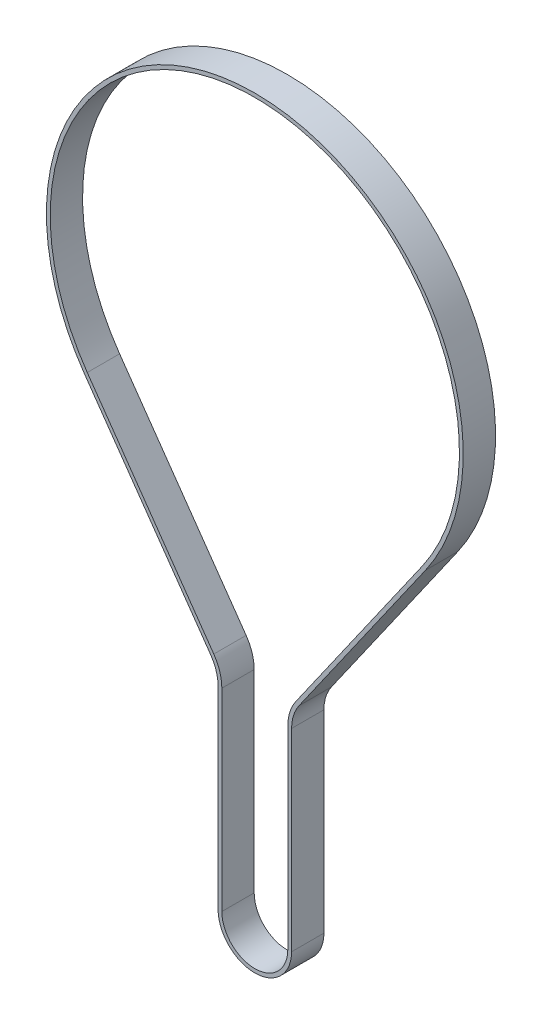
ISO-10303-21;
HEADER;
FILE_DESCRIPTION(('STEP AP214'),'2;1');
FILE_NAME('part.step','',(''),(''),'','','');
FILE_SCHEMA(('AUTOMOTIVE_DESIGN { 1 0 10303 214 1 1 1 1 }'));
ENDSEC;
DATA;
#1=APPLICATION_CONTEXT('core data for automotive mechanical design processes');
#2=APPLICATION_PROTOCOL_DEFINITION('international standard','automotive_design',2000,#1);
#3=PRODUCT_CONTEXT('',#1,'mechanical');
#4=PRODUCT('Part','Part','',(#3));
#5=PRODUCT_RELATED_PRODUCT_CATEGORY('part','',(#4));
#6=PRODUCT_DEFINITION_FORMATION('','',#4);
#7=PRODUCT_DEFINITION_CONTEXT('part definition',#1,'design');
#8=PRODUCT_DEFINITION('design','',#6,#7);
#9=PRODUCT_DEFINITION_SHAPE('','',#8);
#10=(LENGTH_UNIT() NAMED_UNIT(*) SI_UNIT(.MILLI.,.METRE.));
#11=(NAMED_UNIT(*) PLANE_ANGLE_UNIT() SI_UNIT($,.RADIAN.));
#12=(NAMED_UNIT(*) SI_UNIT($,.STERADIAN.) SOLID_ANGLE_UNIT());
#13=UNCERTAINTY_MEASURE_WITH_UNIT(LENGTH_MEASURE(1.E-05),#10,'distance_accuracy_value','');
#14=(GEOMETRIC_REPRESENTATION_CONTEXT(3) GLOBAL_UNCERTAINTY_ASSIGNED_CONTEXT((#13)) GLOBAL_UNIT_ASSIGNED_CONTEXT((#10,
#11,#12)) REPRESENTATION_CONTEXT('',''));
#15=CARTESIAN_POINT('',(0.,0.,0.));
#16=DIRECTION('',(0.,0.,1.));
#17=DIRECTION('',(1.,0.,0.));
#18=AXIS2_PLACEMENT_3D('',#15,#16,#17);
#19=CARTESIAN_POINT('',(-14.3662,35.8706999567669,6.));
#20=DIRECTION('',(0.,0.,1.));
#21=DIRECTION('',(1.,0.,0.));
#22=AXIS2_PLACEMENT_3D('',#19,#20,#21);
#23=PLANE('',#22);
#24=CARTESIAN_POINT('',(-14.3662,35.8706999567669,6.));
#25=DIRECTION('',(0.,0.,-1.));
#26=DIRECTION('',(1.,0.,0.));
#27=AXIS2_PLACEMENT_3D('',#24,#25,#26);
#28=CIRCLE('',#27,7.55);
#29=CARTESIAN_POINT('',(-8.18313892876234,40.20339609074,6.));
#30=VERTEX_POINT('',#29);
#31=CARTESIAN_POINT('',(-6.8162,35.8706999567669,6.));
#32=VERTEX_POINT('',#31);
#33=EDGE_CURVE('E211',#30,#32,#28,.T.);
#34=ORIENTED_EDGE('',*,*,#33,.T.);
#35=DIRECTION('',(0.,-1.,0.));
#36=VECTOR('',#35,1.);
#37=CARTESIAN_POINT('',(-6.8162,35.8706999567669,6.));
#38=LINE('',#37,#36);
#39=CARTESIAN_POINT('',(-6.8162,0.,6.));
#40=VERTEX_POINT('',#39);
#41=EDGE_CURVE('E214',#32,#40,#38,.T.);
#42=ORIENTED_EDGE('',*,*,#41,.T.);
#43=CARTESIAN_POINT('',(0.,0.,6.));
#44=DIRECTION('',(0.,0.,1.));
#45=DIRECTION('',(1.,0.,0.));
#46=AXIS2_PLACEMENT_3D('',#43,#44,#45);
#47=CIRCLE('',#46,6.8162);
#48=CARTESIAN_POINT('',(6.8162,0.,6.));
#49=VERTEX_POINT('',#48);
#50=EDGE_CURVE('E217',#40,#49,#47,.T.);
#51=ORIENTED_EDGE('',*,*,#50,.T.);
#52=DIRECTION('',(0.,1.,0.));
#53=VECTOR('',#52,1.);
#54=CARTESIAN_POINT('',(6.8162,0.,6.));
#55=LINE('',#54,#53);
#56=CARTESIAN_POINT('',(6.8162,35.8706999567669,6.));
#57=VERTEX_POINT('',#56);
#58=EDGE_CURVE('E219',#49,#57,#55,.T.);
#59=ORIENTED_EDGE('',*,*,#58,.T.);
#60=CARTESIAN_POINT('',(14.3662,35.8706999567669,6.));
#61=DIRECTION('',(0.,0.,-1.));
#62=DIRECTION('',(1.,0.,0.));
#63=AXIS2_PLACEMENT_3D('',#60,#61,#62);
#64=CIRCLE('',#63,7.55);
#65=CARTESIAN_POINT('',(8.18313892876234,40.20339609074,6.));
#66=VERTEX_POINT('',#65);
#67=EDGE_CURVE('E221',#57,#66,#64,.T.);
#68=ORIENTED_EDGE('',*,*,#67,.T.);
#69=DIRECTION('',(0.57386703761233,0.818948486256644,0.));
#70=VECTOR('',#69,1.);
#71=CARTESIAN_POINT('',(8.18313892876234,40.20339609074,6.));
#72=LINE('',#71,#70);
#73=CARTESIAN_POINT('',(31.6500659380578,73.6923457807556,6.));
#74=VERTEX_POINT('',#73);
#75=EDGE_CURVE('E223',#66,#74,#72,.T.);
#76=ORIENTED_EDGE('',*,*,#75,.T.);
#77=CARTESIAN_POINT('',(0.,95.8706999567669,6.));
#78=DIRECTION('',(0.,0.,1.));
#79=DIRECTION('',(1.,0.,0.));
#80=AXIS2_PLACEMENT_3D('',#77,#78,#79);
#81=CIRCLE('',#80,38.6472);
#82=CARTESIAN_POINT('',(-31.6500659380578,73.6923457807557,6.));
#83=VERTEX_POINT('',#82);
#84=EDGE_CURVE('E225',#74,#83,#81,.T.);
#85=ORIENTED_EDGE('',*,*,#84,.T.);
#86=DIRECTION('',(0.573867037612331,-0.818948486256644,0.));
#87=VECTOR('',#86,1.);
#88=CARTESIAN_POINT('',(-31.6500659380578,73.6923457807557,6.));
#89=LINE('',#88,#87);
#90=EDGE_CURVE('E227',#83,#30,#89,.T.);
#91=ORIENTED_EDGE('',*,*,#90,.T.);
#92=EDGE_LOOP('',(#34,#42,#51,#59,#68,#76,#85,#91));
#93=FACE_BOUND('',#92,.T.);
#94=DIRECTION('',(0.,-1.,0.));
#95=VECTOR('',#94,1.);
#96=CARTESIAN_POINT('',(-6.1162,35.8706999567669,6.));
#97=LINE('',#96,#95);
#98=CARTESIAN_POINT('',(-6.1162,35.8706999567669,6.));
#99=VERTEX_POINT('',#98);
#100=CARTESIAN_POINT('',(-6.1162,0.,6.));
#101=VERTEX_POINT('',#100);
#102=EDGE_CURVE('E154',#99,#101,#97,.T.);
#103=ORIENTED_EDGE('',*,*,#102,.F.);
#104=CARTESIAN_POINT('',(-14.3662,35.8706999567669,6.));
#105=DIRECTION('',(0.,0.,-1.));
#106=DIRECTION('',(1.,0.,0.));
#107=AXIS2_PLACEMENT_3D('',#104,#105,#106);
#108=CIRCLE('',#107,8.25);
#109=CARTESIAN_POINT('',(-7.60987498838269,40.6051030170686,6.));
#110=VERTEX_POINT('',#109);
#111=EDGE_CURVE('E146',#110,#99,#108,.T.);
#112=ORIENTED_EDGE('',*,*,#111,.F.);
#113=DIRECTION('',(0.573867037612331,-0.818948486256644,0.));
#114=VECTOR('',#113,1.);
#115=CARTESIAN_POINT('',(-31.0768019976781,74.0940527070843,6.));
#116=LINE('',#115,#114);
#117=CARTESIAN_POINT('',(-31.0768019976781,74.0940527070843,6.));
#118=VERTEX_POINT('',#117);
#119=EDGE_CURVE('E179',#118,#110,#116,.T.);
#120=ORIENTED_EDGE('',*,*,#119,.F.);
#121=CARTESIAN_POINT('',(0.,95.8706999567669,6.));
#122=DIRECTION('',(0.,0.,1.));
#123=DIRECTION('',(1.,0.,0.));
#124=AXIS2_PLACEMENT_3D('',#121,#122,#123);
#125=CIRCLE('',#124,37.9472);
#126=CARTESIAN_POINT('',(31.0768019976781,74.0940527070843,6.));
#127=VERTEX_POINT('',#126);
#128=EDGE_CURVE('E177',#127,#118,#125,.T.);
#129=ORIENTED_EDGE('',*,*,#128,.F.);
#130=DIRECTION('',(0.57386703761233,0.818948486256644,0.));
#131=VECTOR('',#130,1.);
#132=CARTESIAN_POINT('',(7.60987498838269,40.6051030170686,6.));
#133=LINE('',#132,#131);
#134=CARTESIAN_POINT('',(7.60987498838269,40.6051030170686,6.));
#135=VERTEX_POINT('',#134);
#136=EDGE_CURVE('E175',#135,#127,#133,.T.);
#137=ORIENTED_EDGE('',*,*,#136,.F.);
#138=CARTESIAN_POINT('',(14.3662,35.8706999567669,6.));
#139=DIRECTION('',(0.,0.,-1.));
#140=DIRECTION('',(1.,0.,0.));
#141=AXIS2_PLACEMENT_3D('',#138,#139,#140);
#142=CIRCLE('',#141,8.25);
#143=CARTESIAN_POINT('',(6.1162,35.8706999567669,6.));
#144=VERTEX_POINT('',#143);
#145=EDGE_CURVE('E173',#144,#135,#142,.T.);
#146=ORIENTED_EDGE('',*,*,#145,.F.);
#147=DIRECTION('',(0.,1.,0.));
#148=VECTOR('',#147,1.);
#149=CARTESIAN_POINT('',(6.1162,0.,6.));
#150=LINE('',#149,#148);
#151=CARTESIAN_POINT('',(6.1162,0.,6.));
#152=VERTEX_POINT('',#151);
#153=EDGE_CURVE('E169',#152,#144,#150,.T.);
#154=ORIENTED_EDGE('',*,*,#153,.F.);
#155=CARTESIAN_POINT('',(0.,0.,6.));
#156=DIRECTION('',(0.,0.,1.));
#157=DIRECTION('',(1.,0.,0.));
#158=AXIS2_PLACEMENT_3D('',#155,#156,#157);
#159=CIRCLE('',#158,6.1162);
#160=EDGE_CURVE('E167',#101,#152,#159,.T.);
#161=ORIENTED_EDGE('',*,*,#160,.F.);
#162=EDGE_LOOP('',(#103,#112,#120,#129,#137,#146,#154,#161));
#163=FACE_BOUND('',#162,.T.);
#164=ADVANCED_FACE('F33',(#93,#163),#23,.T.);
#165=CARTESIAN_POINT('',(-14.3662,35.8706999567669,0.));
#166=DIRECTION('',(0.,0.,1.));
#167=DIRECTION('',(1.,0.,0.));
#168=AXIS2_PLACEMENT_3D('',#165,#166,#167);
#169=PLANE('',#168);
#170=CARTESIAN_POINT('',(-14.3662,35.8706999567669,0.));
#171=DIRECTION('',(0.,0.,-1.));
#172=DIRECTION('',(1.,0.,0.));
#173=AXIS2_PLACEMENT_3D('',#170,#171,#172);
#174=CIRCLE('',#173,7.55);
#175=CARTESIAN_POINT('',(-8.18313892876234,40.20339609074,0.));
#176=VERTEX_POINT('',#175);
#177=CARTESIAN_POINT('',(-6.8162,35.8706999567669,0.));
#178=VERTEX_POINT('',#177);
#179=EDGE_CURVE('E162',#176,#178,#174,.T.);
#180=ORIENTED_EDGE('',*,*,#179,.F.);
#181=DIRECTION('',(0.573867037612331,-0.818948486256644,0.));
#182=VECTOR('',#181,1.);
#183=CARTESIAN_POINT('',(-31.6500659380578,73.6923457807557,0.));
#184=LINE('',#183,#182);
#185=CARTESIAN_POINT('',(-31.6500659380578,73.6923457807557,0.));
#186=VERTEX_POINT('',#185);
#187=EDGE_CURVE('E215',#186,#176,#184,.T.);
#188=ORIENTED_EDGE('',*,*,#187,.F.);
#189=CARTESIAN_POINT('',(0.,95.8706999567669,0.));
#190=DIRECTION('',(0.,0.,1.));
#191=DIRECTION('',(1.,0.,0.));
#192=AXIS2_PLACEMENT_3D('',#189,#190,#191);
#193=CIRCLE('',#192,38.6472);
#194=CARTESIAN_POINT('',(31.6500659380578,73.6923457807556,0.));
#195=VERTEX_POINT('',#194);
#196=EDGE_CURVE('E242',#195,#186,#193,.T.);
#197=ORIENTED_EDGE('',*,*,#196,.F.);
#198=DIRECTION('',(0.57386703761233,0.818948486256644,0.));
#199=VECTOR('',#198,1.);
#200=CARTESIAN_POINT('',(8.18313892876234,40.20339609074,0.));
#201=LINE('',#200,#199);
#202=CARTESIAN_POINT('',(8.18313892876234,40.20339609074,0.));
#203=VERTEX_POINT('',#202);
#204=EDGE_CURVE('E240',#203,#195,#201,.T.);
#205=ORIENTED_EDGE('',*,*,#204,.F.);
#206=CARTESIAN_POINT('',(14.3662,35.8706999567669,0.));
#207=DIRECTION('',(0.,0.,-1.));
#208=DIRECTION('',(1.,0.,0.));
#209=AXIS2_PLACEMENT_3D('',#206,#207,#208);
#210=CIRCLE('',#209,7.55);
#211=CARTESIAN_POINT('',(6.8162,35.8706999567669,0.));
#212=VERTEX_POINT('',#211);
#213=EDGE_CURVE('E238',#212,#203,#210,.T.);
#214=ORIENTED_EDGE('',*,*,#213,.F.);
#215=DIRECTION('',(0.,1.,0.));
#216=VECTOR('',#215,1.);
#217=CARTESIAN_POINT('',(6.8162,0.,0.));
#218=LINE('',#217,#216);
#219=CARTESIAN_POINT('',(6.8162,0.,0.));
#220=VERTEX_POINT('',#219);
#221=EDGE_CURVE('E236',#220,#212,#218,.T.);
#222=ORIENTED_EDGE('',*,*,#221,.F.);
#223=CARTESIAN_POINT('',(0.,0.,0.));
#224=DIRECTION('',(0.,0.,1.));
#225=DIRECTION('',(1.,0.,0.));
#226=AXIS2_PLACEMENT_3D('',#223,#224,#225);
#227=CIRCLE('',#226,6.8162);
#228=CARTESIAN_POINT('',(-6.8162,0.,0.));
#229=VERTEX_POINT('',#228);
#230=EDGE_CURVE('E234',#229,#220,#227,.T.);
#231=ORIENTED_EDGE('',*,*,#230,.F.);
#232=DIRECTION('',(0.,-1.,0.));
#233=VECTOR('',#232,1.);
#234=CARTESIAN_POINT('',(-6.8162,35.8706999567669,0.));
#235=LINE('',#234,#233);
#236=EDGE_CURVE('E232',#178,#229,#235,.T.);
#237=ORIENTED_EDGE('',*,*,#236,.F.);
#238=EDGE_LOOP('',(#180,#188,#197,#205,#214,#222,#231,#237));
#239=FACE_BOUND('',#238,.T.);
#240=CARTESIAN_POINT('',(-14.3662,35.8706999567669,0.));
#241=DIRECTION('',(0.,0.,-1.));
#242=DIRECTION('',(1.,0.,0.));
#243=AXIS2_PLACEMENT_3D('',#240,#241,#242);
#244=CIRCLE('',#243,8.25);
#245=CARTESIAN_POINT('',(-7.60987498838268,40.6051030170686,0.));
#246=VERTEX_POINT('',#245);
#247=CARTESIAN_POINT('',(-6.1162,35.8706999567669,0.));
#248=VERTEX_POINT('',#247);
#249=EDGE_CURVE('E56',#246,#248,#244,.T.);
#250=ORIENTED_EDGE('',*,*,#249,.T.);
#251=DIRECTION('',(0.,-1.,0.));
#252=VECTOR('',#251,1.);
#253=CARTESIAN_POINT('',(-6.1162,35.8706999567669,0.));
#254=LINE('',#253,#252);
#255=CARTESIAN_POINT('',(-6.1162,0.,0.));
#256=VERTEX_POINT('',#255);
#257=EDGE_CURVE('E161',#248,#256,#254,.T.);
#258=ORIENTED_EDGE('',*,*,#257,.T.);
#259=CARTESIAN_POINT('',(0.,0.,0.));
#260=DIRECTION('',(0.,0.,1.));
#261=DIRECTION('',(1.,0.,0.));
#262=AXIS2_PLACEMENT_3D('',#259,#260,#261);
#263=CIRCLE('',#262,6.1162);
#264=CARTESIAN_POINT('',(6.1162,0.,0.));
#265=VERTEX_POINT('',#264);
#266=EDGE_CURVE('E183',#256,#265,#263,.T.);
#267=ORIENTED_EDGE('',*,*,#266,.T.);
#268=DIRECTION('',(0.,1.,0.));
#269=VECTOR('',#268,1.);
#270=CARTESIAN_POINT('',(6.1162,0.,0.));
#271=LINE('',#270,#269);
#272=CARTESIAN_POINT('',(6.1162,35.8706999567669,0.));
#273=VERTEX_POINT('',#272);
#274=EDGE_CURVE('E186',#265,#273,#271,.T.);
#275=ORIENTED_EDGE('',*,*,#274,.T.);
#276=CARTESIAN_POINT('',(14.3662,35.8706999567669,0.));
#277=DIRECTION('',(0.,0.,-1.));
#278=DIRECTION('',(1.,0.,0.));
#279=AXIS2_PLACEMENT_3D('',#276,#277,#278);
#280=CIRCLE('',#279,8.25);
#281=CARTESIAN_POINT('',(7.60987498838269,40.6051030170686,0.));
#282=VERTEX_POINT('',#281);
#283=EDGE_CURVE('E189',#273,#282,#280,.T.);
#284=ORIENTED_EDGE('',*,*,#283,.T.);
#285=DIRECTION('',(0.57386703761233,0.818948486256644,0.));
#286=VECTOR('',#285,1.);
#287=CARTESIAN_POINT('',(7.60987498838269,40.6051030170686,0.));
#288=LINE('',#287,#286);
#289=CARTESIAN_POINT('',(31.0768019976781,74.0940527070843,0.));
#290=VERTEX_POINT('',#289);
#291=EDGE_CURVE('E192',#282,#290,#288,.T.);
#292=ORIENTED_EDGE('',*,*,#291,.T.);
#293=CARTESIAN_POINT('',(0.,95.8706999567669,0.));
#294=DIRECTION('',(0.,0.,1.));
#295=DIRECTION('',(1.,0.,0.));
#296=AXIS2_PLACEMENT_3D('',#293,#294,#295);
#297=CIRCLE('',#296,37.9472);
#298=CARTESIAN_POINT('',(-31.0768019976781,74.0940527070843,0.));
#299=VERTEX_POINT('',#298);
#300=EDGE_CURVE('E195',#290,#299,#297,.T.);
#301=ORIENTED_EDGE('',*,*,#300,.T.);
#302=DIRECTION('',(0.573867037612331,-0.818948486256644,0.));
#303=VECTOR('',#302,1.);
#304=CARTESIAN_POINT('',(-31.0768019976781,74.0940527070843,0.));
#305=LINE('',#304,#303);
#306=EDGE_CURVE('E155',#299,#246,#305,.T.);
#307=ORIENTED_EDGE('',*,*,#306,.T.);
#308=EDGE_LOOP('',(#250,#258,#267,#275,#284,#292,#301,#307));
#309=FACE_BOUND('',#308,.T.);
#310=ADVANCED_FACE('F272',(#239,#309),#169,.F.);
#311=CARTESIAN_POINT('',(-14.3662,35.8706999567669,6.));
#312=DIRECTION('',(0.,0.,-1.));
#313=DIRECTION('',(-1.,0.,0.));
#314=AXIS2_PLACEMENT_3D('',#311,#312,#313);
#315=CYLINDRICAL_SURFACE('',#314,7.55);
#316=ORIENTED_EDGE('',*,*,#179,.T.);
#317=DIRECTION('',(0.,0.,-1.));
#318=VECTOR('',#317,1.);
#319=CARTESIAN_POINT('',(-6.8162,35.8706999567669,6.));
#320=LINE('',#319,#318);
#321=EDGE_CURVE('E11',#32,#178,#320,.T.);
#322=ORIENTED_EDGE('',*,*,#321,.F.);
#323=ORIENTED_EDGE('',*,*,#33,.F.);
#324=DIRECTION('',(0.,0.,-1.));
#325=VECTOR('',#324,1.);
#326=CARTESIAN_POINT('',(-8.18313892876234,40.20339609074,6.));
#327=LINE('',#326,#325);
#328=EDGE_CURVE('E229',#30,#176,#327,.T.);
#329=ORIENTED_EDGE('',*,*,#328,.T.);
#330=EDGE_LOOP('',(#316,#322,#323,#329));
#331=FACE_BOUND('',#330,.T.);
#332=ADVANCED_FACE('F35',(#331),#315,.F.);
#333=CARTESIAN_POINT('',(-6.8162,35.8706999567669,6.));
#334=DIRECTION('',(1.,0.,0.));
#335=DIRECTION('',(0.,1.,0.));
#336=AXIS2_PLACEMENT_3D('',#333,#334,#335);
#337=PLANE('',#336);
#338=ORIENTED_EDGE('',*,*,#236,.T.);
#339=DIRECTION('',(0.,0.,-1.));
#340=VECTOR('',#339,1.);
#341=CARTESIAN_POINT('',(-6.8162,0.,6.));
#342=LINE('',#341,#340);
#343=EDGE_CURVE('E41',#40,#229,#342,.T.);
#344=ORIENTED_EDGE('',*,*,#343,.F.);
#345=ORIENTED_EDGE('',*,*,#41,.F.);
#346=ORIENTED_EDGE('',*,*,#321,.T.);
#347=EDGE_LOOP('',(#338,#344,#345,#346));
#348=FACE_BOUND('',#347,.T.);
#349=ADVANCED_FACE('F289',(#348),#337,.F.);
#350=CARTESIAN_POINT('',(0.,0.,6.));
#351=DIRECTION('',(0.,0.,-1.));
#352=DIRECTION('',(-1.,0.,0.));
#353=AXIS2_PLACEMENT_3D('',#350,#351,#352);
#354=CYLINDRICAL_SURFACE('',#353,6.8162);
#355=ORIENTED_EDGE('',*,*,#230,.T.);
#356=DIRECTION('',(0.,0.,-1.));
#357=VECTOR('',#356,1.);
#358=CARTESIAN_POINT('',(6.8162,0.,6.));
#359=LINE('',#358,#357);
#360=EDGE_CURVE('E259',#49,#220,#359,.T.);
#361=ORIENTED_EDGE('',*,*,#360,.F.);
#362=ORIENTED_EDGE('',*,*,#50,.F.);
#363=ORIENTED_EDGE('',*,*,#343,.T.);
#364=EDGE_LOOP('',(#355,#361,#362,#363));
#365=FACE_BOUND('',#364,.T.);
#366=ADVANCED_FACE('F266',(#365),#354,.T.);
#367=CARTESIAN_POINT('',(6.8162,0.,6.));
#368=DIRECTION('',(-1.,0.,0.));
#369=DIRECTION('',(0.,-1.,0.));
#370=AXIS2_PLACEMENT_3D('',#367,#368,#369);
#371=PLANE('',#370);
#372=ORIENTED_EDGE('',*,*,#221,.T.);
#373=DIRECTION('',(0.,0.,-1.));
#374=VECTOR('',#373,1.);
#375=CARTESIAN_POINT('',(6.8162,35.8706999567669,6.));
#376=LINE('',#375,#374);
#377=EDGE_CURVE('E256',#57,#212,#376,.T.);
#378=ORIENTED_EDGE('',*,*,#377,.F.);
#379=ORIENTED_EDGE('',*,*,#58,.F.);
#380=ORIENTED_EDGE('',*,*,#360,.T.);
#381=EDGE_LOOP('',(#372,#378,#379,#380));
#382=FACE_BOUND('',#381,.T.);
#383=ADVANCED_FACE('F278',(#382),#371,.F.);
#384=CARTESIAN_POINT('',(14.3662,35.8706999567669,6.));
#385=DIRECTION('',(0.,0.,-1.));
#386=DIRECTION('',(-1.,0.,0.));
#387=AXIS2_PLACEMENT_3D('',#384,#385,#386);
#388=CYLINDRICAL_SURFACE('',#387,7.55);
#389=ORIENTED_EDGE('',*,*,#213,.T.);
#390=DIRECTION('',(0.,0.,-1.));
#391=VECTOR('',#390,1.);
#392=CARTESIAN_POINT('',(8.18313892876234,40.20339609074,6.));
#393=LINE('',#392,#391);
#394=EDGE_CURVE('E253',#66,#203,#393,.T.);
#395=ORIENTED_EDGE('',*,*,#394,.F.);
#396=ORIENTED_EDGE('',*,*,#67,.F.);
#397=ORIENTED_EDGE('',*,*,#377,.T.);
#398=EDGE_LOOP('',(#389,#395,#396,#397));
#399=FACE_BOUND('',#398,.T.);
#400=ADVANCED_FACE('F282',(#399),#388,.F.);
#401=CARTESIAN_POINT('',(8.18313892876234,40.20339609074,6.));
#402=DIRECTION('',(-0.818948486256644,0.57386703761233,0.));
#403=DIRECTION('',(-0.57386703761233,-0.818948486256644,0.));
#404=AXIS2_PLACEMENT_3D('',#401,#402,#403);
#405=PLANE('',#404);
#406=ORIENTED_EDGE('',*,*,#204,.T.);
#407=DIRECTION('',(0.,0.,-1.));
#408=VECTOR('',#407,1.);
#409=CARTESIAN_POINT('',(31.6500659380578,73.6923457807556,6.));
#410=LINE('',#409,#408);
#411=EDGE_CURVE('E250',#74,#195,#410,.T.);
#412=ORIENTED_EDGE('',*,*,#411,.F.);
#413=ORIENTED_EDGE('',*,*,#75,.F.);
#414=ORIENTED_EDGE('',*,*,#394,.T.);
#415=EDGE_LOOP('',(#406,#412,#413,#414));
#416=FACE_BOUND('',#415,.T.);
#417=ADVANCED_FACE('F302',(#416),#405,.F.);
#418=CARTESIAN_POINT('',(0.,95.8706999567669,6.));
#419=DIRECTION('',(0.,0.,-1.));
#420=DIRECTION('',(-1.,0.,0.));
#421=AXIS2_PLACEMENT_3D('',#418,#419,#420);
#422=CYLINDRICAL_SURFACE('',#421,38.6472);
#423=ORIENTED_EDGE('',*,*,#196,.T.);
#424=DIRECTION('',(0.,0.,-1.));
#425=VECTOR('',#424,1.);
#426=CARTESIAN_POINT('',(-31.6500659380578,73.6923457807557,6.));
#427=LINE('',#426,#425);
#428=EDGE_CURVE('E247',#83,#186,#427,.T.);
#429=ORIENTED_EDGE('',*,*,#428,.F.);
#430=ORIENTED_EDGE('',*,*,#84,.F.);
#431=ORIENTED_EDGE('',*,*,#411,.T.);
#432=EDGE_LOOP('',(#423,#429,#430,#431));
#433=FACE_BOUND('',#432,.T.);
#434=ADVANCED_FACE('F300',(#433),#422,.T.);
#435=CARTESIAN_POINT('',(-31.6500659380578,73.6923457807557,6.));
#436=DIRECTION('',(0.818948486256644,0.573867037612331,0.));
#437=DIRECTION('',(-0.573867037612331,0.818948486256644,0.));
#438=AXIS2_PLACEMENT_3D('',#435,#436,#437);
#439=PLANE('',#438);
#440=ORIENTED_EDGE('',*,*,#187,.T.);
#441=ORIENTED_EDGE('',*,*,#328,.F.);
#442=ORIENTED_EDGE('',*,*,#90,.F.);
#443=ORIENTED_EDGE('',*,*,#428,.T.);
#444=EDGE_LOOP('',(#440,#441,#442,#443));
#445=FACE_BOUND('',#444,.T.);
#446=ADVANCED_FACE('F295',(#445),#439,.F.);
#447=CARTESIAN_POINT('',(-14.3662,35.8706999567669,6.));
#448=DIRECTION('',(0.,0.,-1.));
#449=DIRECTION('',(-1.,0.,0.));
#450=AXIS2_PLACEMENT_3D('',#447,#448,#449);
#451=CYLINDRICAL_SURFACE('',#450,8.25);
#452=ORIENTED_EDGE('',*,*,#249,.F.);
#453=DIRECTION('',(0.,0.,-1.));
#454=VECTOR('',#453,1.);
#455=CARTESIAN_POINT('',(-7.60987498838269,40.6051030170686,6.));
#456=LINE('',#455,#454);
#457=EDGE_CURVE('E150',#110,#246,#456,.T.);
#458=ORIENTED_EDGE('',*,*,#457,.F.);
#459=ORIENTED_EDGE('',*,*,#111,.T.);
#460=DIRECTION('',(0.,0.,-1.));
#461=VECTOR('',#460,1.);
#462=CARTESIAN_POINT('',(-6.1162,35.8706999567669,6.));
#463=LINE('',#462,#461);
#464=EDGE_CURVE('E149',#99,#248,#463,.T.);
#465=ORIENTED_EDGE('',*,*,#464,.T.);
#466=EDGE_LOOP('',(#452,#458,#459,#465));
#467=FACE_BOUND('',#466,.T.);
#468=ADVANCED_FACE('F148',(#467),#451,.T.);
#469=CARTESIAN_POINT('',(-6.1162,35.8706999567669,6.));
#470=DIRECTION('',(1.,0.,0.));
#471=DIRECTION('',(0.,1.,0.));
#472=AXIS2_PLACEMENT_3D('',#469,#470,#471);
#473=PLANE('',#472);
#474=ORIENTED_EDGE('',*,*,#257,.F.);
#475=ORIENTED_EDGE('',*,*,#464,.F.);
#476=ORIENTED_EDGE('',*,*,#102,.T.);
#477=DIRECTION('',(0.,0.,-1.));
#478=VECTOR('',#477,1.);
#479=CARTESIAN_POINT('',(-6.1162,0.,6.));
#480=LINE('',#479,#478);
#481=EDGE_CURVE('E163',#101,#256,#480,.T.);
#482=ORIENTED_EDGE('',*,*,#481,.T.);
#483=EDGE_LOOP('',(#474,#475,#476,#482));
#484=FACE_BOUND('',#483,.T.);
#485=ADVANCED_FACE('F158',(#484),#473,.T.);
#486=CARTESIAN_POINT('',(0.,0.,6.));
#487=DIRECTION('',(0.,0.,-1.));
#488=DIRECTION('',(-1.,0.,0.));
#489=AXIS2_PLACEMENT_3D('',#486,#487,#488);
#490=CYLINDRICAL_SURFACE('',#489,6.1162);
#491=ORIENTED_EDGE('',*,*,#266,.F.);
#492=ORIENTED_EDGE('',*,*,#481,.F.);
#493=ORIENTED_EDGE('',*,*,#160,.T.);
#494=DIRECTION('',(0.,0.,-1.));
#495=VECTOR('',#494,1.);
#496=CARTESIAN_POINT('',(6.1162,0.,6.));
#497=LINE('',#496,#495);
#498=EDGE_CURVE('E208',#152,#265,#497,.T.);
#499=ORIENTED_EDGE('',*,*,#498,.T.);
#500=EDGE_LOOP('',(#491,#492,#493,#499));
#501=FACE_BOUND('',#500,.T.);
#502=ADVANCED_FACE('F327',(#501),#490,.F.);
#503=CARTESIAN_POINT('',(6.1162,0.,6.));
#504=DIRECTION('',(-1.,0.,0.));
#505=DIRECTION('',(0.,0.,1.));
#506=AXIS2_PLACEMENT_3D('',#503,#504,#505);
#507=PLANE('',#506);
#508=ORIENTED_EDGE('',*,*,#274,.F.);
#509=ORIENTED_EDGE('',*,*,#498,.F.);
#510=ORIENTED_EDGE('',*,*,#153,.T.);
#511=DIRECTION('',(0.,0.,-1.));
#512=VECTOR('',#511,1.);
#513=CARTESIAN_POINT('',(6.1162,35.8706999567669,6.));
#514=LINE('',#513,#512);
#515=EDGE_CURVE('E206',#144,#273,#514,.T.);
#516=ORIENTED_EDGE('',*,*,#515,.T.);
#517=EDGE_LOOP('',(#508,#509,#510,#516));
#518=FACE_BOUND('',#517,.T.);
#519=ADVANCED_FACE('F331',(#518),#507,.T.);
#520=CARTESIAN_POINT('',(14.3662,35.8706999567669,6.));
#521=DIRECTION('',(0.,0.,-1.));
#522=DIRECTION('',(-1.,0.,0.));
#523=AXIS2_PLACEMENT_3D('',#520,#521,#522);
#524=CYLINDRICAL_SURFACE('',#523,8.25);
#525=ORIENTED_EDGE('',*,*,#283,.F.);
#526=ORIENTED_EDGE('',*,*,#515,.F.);
#527=ORIENTED_EDGE('',*,*,#145,.T.);
#528=DIRECTION('',(0.,0.,-1.));
#529=VECTOR('',#528,1.);
#530=CARTESIAN_POINT('',(7.60987498838269,40.6051030170686,6.));
#531=LINE('',#530,#529);
#532=EDGE_CURVE('E204',#135,#282,#531,.T.);
#533=ORIENTED_EDGE('',*,*,#532,.T.);
#534=EDGE_LOOP('',(#525,#526,#527,#533));
#535=FACE_BOUND('',#534,.T.);
#536=ADVANCED_FACE('F337',(#535),#524,.T.);
#537=CARTESIAN_POINT('',(7.60987498838269,40.6051030170686,6.));
#538=DIRECTION('',(-0.818948486256644,0.57386703761233,0.));
#539=DIRECTION('',(-0.57386703761233,-0.818948486256644,0.));
#540=AXIS2_PLACEMENT_3D('',#537,#538,#539);
#541=PLANE('',#540);
#542=ORIENTED_EDGE('',*,*,#291,.F.);
#543=ORIENTED_EDGE('',*,*,#532,.F.);
#544=ORIENTED_EDGE('',*,*,#136,.T.);
#545=DIRECTION('',(0.,0.,-1.));
#546=VECTOR('',#545,1.);
#547=CARTESIAN_POINT('',(31.0768019976781,74.0940527070843,6.));
#548=LINE('',#547,#546);
#549=EDGE_CURVE('E202',#127,#290,#548,.T.);
#550=ORIENTED_EDGE('',*,*,#549,.T.);
#551=EDGE_LOOP('',(#542,#543,#544,#550));
#552=FACE_BOUND('',#551,.T.);
#553=ADVANCED_FACE('F341',(#552),#541,.T.);
#554=CARTESIAN_POINT('',(0.,95.8706999567669,6.));
#555=DIRECTION('',(0.,0.,-1.));
#556=DIRECTION('',(-1.,0.,0.));
#557=AXIS2_PLACEMENT_3D('',#554,#555,#556);
#558=CYLINDRICAL_SURFACE('',#557,37.9472);
#559=ORIENTED_EDGE('',*,*,#300,.F.);
#560=ORIENTED_EDGE('',*,*,#549,.F.);
#561=ORIENTED_EDGE('',*,*,#128,.T.);
#562=DIRECTION('',(0.,0.,-1.));
#563=VECTOR('',#562,1.);
#564=CARTESIAN_POINT('',(-31.0768019976781,74.0940527070843,6.));
#565=LINE('',#564,#563);
#566=EDGE_CURVE('E48',#118,#299,#565,.T.);
#567=ORIENTED_EDGE('',*,*,#566,.T.);
#568=EDGE_LOOP('',(#559,#560,#561,#567));
#569=FACE_BOUND('',#568,.T.);
#570=ADVANCED_FACE('F345',(#569),#558,.F.);
#571=CARTESIAN_POINT('',(-31.0768019976781,74.0940527070843,6.));
#572=DIRECTION('',(0.818948486256643,0.57386703761233,0.));
#573=DIRECTION('',(-0.573867037612331,0.818948486256644,0.));
#574=AXIS2_PLACEMENT_3D('',#571,#572,#573);
#575=PLANE('',#574);
#576=ORIENTED_EDGE('',*,*,#306,.F.);
#577=ORIENTED_EDGE('',*,*,#566,.F.);
#578=ORIENTED_EDGE('',*,*,#119,.T.);
#579=ORIENTED_EDGE('',*,*,#457,.T.);
#580=EDGE_LOOP('',(#576,#577,#578,#579));
#581=FACE_BOUND('',#580,.T.);
#582=ADVANCED_FACE('F349',(#581),#575,.T.);
#583=CLOSED_SHELL('',(#164,#310,#332,#349,#366,#383,#400,#417,#434,#446,#468,#485,#502,#519,
#536,#553,#570,#582));
#584=MANIFOLD_SOLID_BREP('B2',#583);
#585=ADVANCED_BREP_SHAPE_REPRESENTATION('',(#18,#584),#14);
#586=SHAPE_DEFINITION_REPRESENTATION(#9,#585);
ENDSEC;
END-ISO-10303-21;
